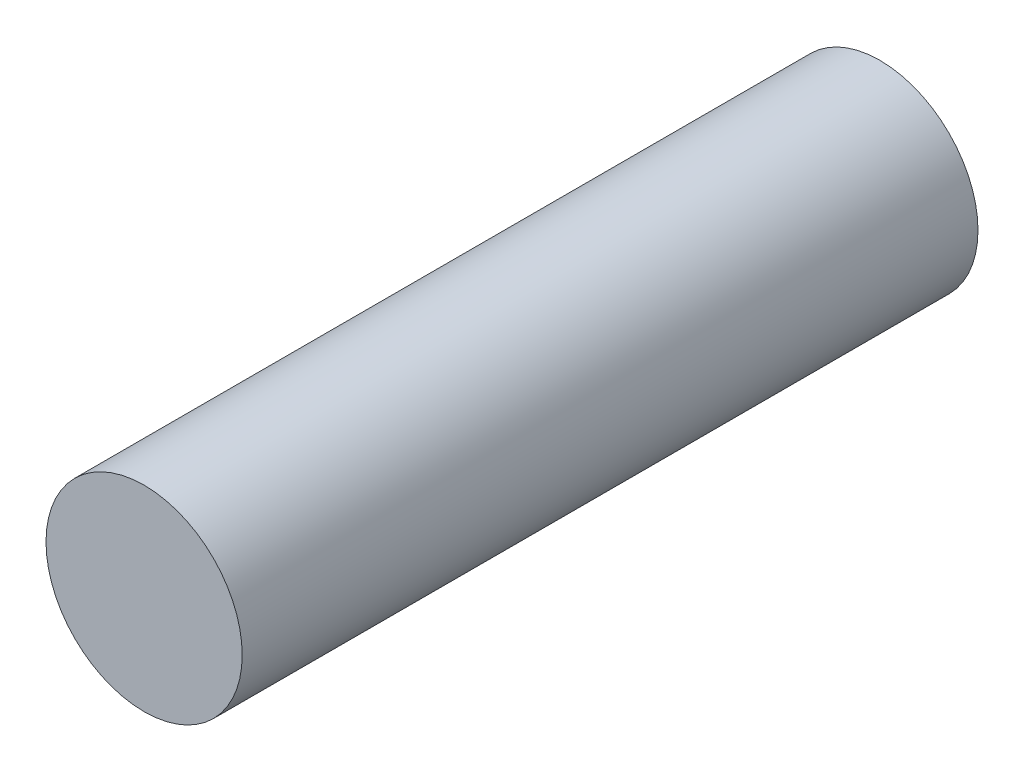
ISO-10303-21;
HEADER;
FILE_DESCRIPTION(('STEP AP214'),'2;1');
FILE_NAME('part.step','',(''),(''),'','','');
FILE_SCHEMA(('AUTOMOTIVE_DESIGN { 1 0 10303 214 1 1 1 1 }'));
ENDSEC;
DATA;
#1=APPLICATION_CONTEXT('core data for automotive mechanical design processes');
#2=APPLICATION_PROTOCOL_DEFINITION('international standard','automotive_design',2000,#1);
#3=PRODUCT_CONTEXT('',#1,'mechanical');
#4=PRODUCT('Part','Part','',(#3));
#5=PRODUCT_RELATED_PRODUCT_CATEGORY('part','',(#4));
#6=PRODUCT_DEFINITION_FORMATION('','',#4);
#7=PRODUCT_DEFINITION_CONTEXT('part definition',#1,'design');
#8=PRODUCT_DEFINITION('design','',#6,#7);
#9=PRODUCT_DEFINITION_SHAPE('','',#8);
#10=(LENGTH_UNIT() NAMED_UNIT(*) SI_UNIT(.MILLI.,.METRE.));
#11=(NAMED_UNIT(*) PLANE_ANGLE_UNIT() SI_UNIT($,.RADIAN.));
#12=(NAMED_UNIT(*) SI_UNIT($,.STERADIAN.) SOLID_ANGLE_UNIT());
#13=UNCERTAINTY_MEASURE_WITH_UNIT(LENGTH_MEASURE(1.E-05),#10,'distance_accuracy_value','');
#14=(GEOMETRIC_REPRESENTATION_CONTEXT(3) GLOBAL_UNCERTAINTY_ASSIGNED_CONTEXT((#13)) GLOBAL_UNIT_ASSIGNED_CONTEXT((#10,
#11,#12)) REPRESENTATION_CONTEXT('',''));
#15=CARTESIAN_POINT('',(0.,0.,0.));
#16=DIRECTION('',(0.,0.,1.));
#17=DIRECTION('',(1.,0.,0.));
#18=AXIS2_PLACEMENT_3D('',#15,#16,#17);
#19=CARTESIAN_POINT('',(0.,0.,-3.));
#20=DIRECTION('',(0.,0.,1.));
#21=DIRECTION('',(1.,0.,0.));
#22=AXIS2_PLACEMENT_3D('',#19,#20,#21);
#23=PLANE('',#22);
#24=CARTESIAN_POINT('',(0.,0.,-3.));
#25=DIRECTION('',(0.,0.,-1.));
#26=DIRECTION('',(-1.,0.,0.));
#27=AXIS2_PLACEMENT_3D('',#24,#25,#26);
#28=CIRCLE('',#27,0.4);
#29=CARTESIAN_POINT('',(-0.4,0.,-3.));
#30=VERTEX_POINT('',#29);
#31=EDGE_CURVE('E17',#30,#30,#28,.F.);
#32=ORIENTED_EDGE('',*,*,#31,.F.);
#33=EDGE_LOOP('',(#32));
#34=FACE_BOUND('',#33,.T.);
#35=ADVANCED_FACE('F14',(#34),#23,.F.);
#36=CARTESIAN_POINT('',(0.,0.,0.));
#37=DIRECTION('',(0.,0.,1.));
#38=DIRECTION('',(1.,0.,0.));
#39=AXIS2_PLACEMENT_3D('',#36,#37,#38);
#40=PLANE('',#39);
#41=CARTESIAN_POINT('',(0.,0.,0.));
#42=DIRECTION('',(0.,0.,-1.));
#43=DIRECTION('',(-1.,0.,0.));
#44=AXIS2_PLACEMENT_3D('',#41,#42,#43);
#45=CIRCLE('',#44,0.4);
#46=CARTESIAN_POINT('',(-0.4,0.,0.));
#47=VERTEX_POINT('',#46);
#48=EDGE_CURVE('E9',#47,#47,#45,.T.);
#49=ORIENTED_EDGE('',*,*,#48,.F.);
#50=EDGE_LOOP('',(#49));
#51=FACE_BOUND('',#50,.T.);
#52=ADVANCED_FACE('F29',(#51),#40,.T.);
#53=CARTESIAN_POINT('',(0.,0.,0.));
#54=DIRECTION('',(0.,0.,-1.));
#55=DIRECTION('',(-1.,0.,0.));
#56=AXIS2_PLACEMENT_3D('',#53,#54,#55);
#57=CYLINDRICAL_SURFACE('',#56,0.4);
#58=ORIENTED_EDGE('',*,*,#48,.T.);
#59=EDGE_LOOP('',(#58));
#60=FACE_BOUND('',#59,.T.);
#61=ORIENTED_EDGE('',*,*,#31,.T.);
#62=EDGE_LOOP('',(#61));
#63=FACE_BOUND('',#62,.T.);
#64=ADVANCED_FACE('F26',(#60,#63),#57,.T.);
#65=CLOSED_SHELL('',(#35,#52,#64));
#66=MANIFOLD_SOLID_BREP('B1',#65);
#67=ADVANCED_BREP_SHAPE_REPRESENTATION('',(#18,#66),#14);
#68=SHAPE_DEFINITION_REPRESENTATION(#9,#67);
ENDSEC;
END-ISO-10303-21;
